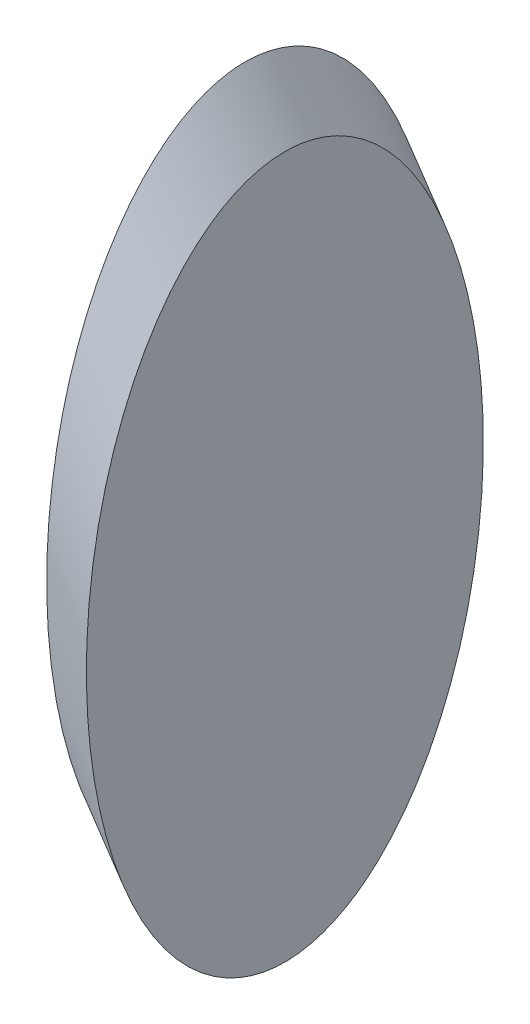
ISO-10303-21;
HEADER;
FILE_DESCRIPTION(('STEP AP214'),'2;1');
FILE_NAME('part.step','',(''),(''),'','','');
FILE_SCHEMA(('AUTOMOTIVE_DESIGN { 1 0 10303 214 1 1 1 1 }'));
ENDSEC;
DATA;
#1=APPLICATION_CONTEXT('core data for automotive mechanical design processes');
#2=APPLICATION_PROTOCOL_DEFINITION('international standard','automotive_design',2000,#1);
#3=PRODUCT_CONTEXT('',#1,'mechanical');
#4=PRODUCT('Part','Part','',(#3));
#5=PRODUCT_RELATED_PRODUCT_CATEGORY('part','',(#4));
#6=PRODUCT_DEFINITION_FORMATION('','',#4);
#7=PRODUCT_DEFINITION_CONTEXT('part definition',#1,'design');
#8=PRODUCT_DEFINITION('design','',#6,#7);
#9=PRODUCT_DEFINITION_SHAPE('','',#8);
#10=(LENGTH_UNIT() NAMED_UNIT(*) SI_UNIT(.MILLI.,.METRE.));
#11=(NAMED_UNIT(*) PLANE_ANGLE_UNIT() SI_UNIT($,.RADIAN.));
#12=(NAMED_UNIT(*) SI_UNIT($,.STERADIAN.) SOLID_ANGLE_UNIT());
#13=UNCERTAINTY_MEASURE_WITH_UNIT(LENGTH_MEASURE(1.E-05),#10,'distance_accuracy_value','');
#14=(GEOMETRIC_REPRESENTATION_CONTEXT(3) GLOBAL_UNCERTAINTY_ASSIGNED_CONTEXT((#13)) GLOBAL_UNIT_ASSIGNED_CONTEXT((#10,
#11,#12)) REPRESENTATION_CONTEXT('',''));
#15=CARTESIAN_POINT('',(0.,0.,0.));
#16=DIRECTION('',(0.,0.,1.));
#17=DIRECTION('',(1.,0.,0.));
#18=AXIS2_PLACEMENT_3D('',#15,#16,#17);
#19=CARTESIAN_POINT('',(-0.999999999999999,19.1437673822593,-10.));
#20=DIRECTION('',(-1.,0.,0.));
#21=DIRECTION('',(0.,0.,1.));
#22=AXIS2_PLACEMENT_3D('',#19,#20,#21);
#23=PLANE('',#22);
#24=CARTESIAN_POINT('',(-0.999999999999997,1.45864203475964,0.));
#25=DIRECTION('',(-1.,0.,0.));
#26=DIRECTION('',(0.,1.,0.));
#27=AXIS2_PLACEMENT_3D('',#24,#25,#26);
#28=ELLIPSE('',#27,17.6851253474996,10.);
#29=CARTESIAN_POINT('',(-0.999999999999997,19.1437673822593,0.));
#30=VERTEX_POINT('',#29);
#31=EDGE_CURVE('E18',#30,#30,#28,.F.);
#32=ORIENTED_EDGE('',*,*,#31,.F.);
#33=EDGE_LOOP('',(#32));
#34=FACE_BOUND('',#33,.T.);
#35=ADVANCED_FACE('F15',(#34),#23,.T.);
#36=CARTESIAN_POINT('',(28.272346968165,-41.2392337090748,0.));
#37=DIRECTION('',(-0.5654469393633,0.824784674181496,0.));
#38=DIRECTION('',(-0.824784674181496,-0.5654469393633,0.));
#39=AXIS2_PLACEMENT_3D('',#36,#37,#38);
#40=CYLINDRICAL_SURFACE('',#39,10.);
#41=ORIENTED_EDGE('',*,*,#31,.T.);
#42=EDGE_LOOP('',(#41));
#43=FACE_BOUND('',#42,.T.);
#44=CARTESIAN_POINT('',(1.,-1.45864203475964,0.));
#45=DIRECTION('',(1.,0.,0.));
#46=DIRECTION('',(0.,1.,0.));
#47=AXIS2_PLACEMENT_3D('',#44,#45,#46);
#48=ELLIPSE('',#47,17.6851253474996,10.);
#49=CARTESIAN_POINT('',(0.999999999999998,16.22648331274,0.));
#50=VERTEX_POINT('',#49);
#51=EDGE_CURVE('E9',#50,#50,#48,.T.);
#52=ORIENTED_EDGE('',*,*,#51,.F.);
#53=EDGE_LOOP('',(#52));
#54=FACE_BOUND('',#53,.T.);
#55=ADVANCED_FACE('F27',(#43,#54),#40,.T.);
#56=CARTESIAN_POINT('',(0.999999999999995,16.22648331274,-10.));
#57=DIRECTION('',(1.,0.,0.));
#58=DIRECTION('',(0.,1.,0.));
#59=AXIS2_PLACEMENT_3D('',#56,#57,#58);
#60=PLANE('',#59);
#61=ORIENTED_EDGE('',*,*,#51,.T.);
#62=EDGE_LOOP('',(#61));
#63=FACE_BOUND('',#62,.T.);
#64=ADVANCED_FACE('F34',(#63),#60,.T.);
#65=CLOSED_SHELL('',(#35,#55,#64));
#66=MANIFOLD_SOLID_BREP('B1',#65);
#67=ADVANCED_BREP_SHAPE_REPRESENTATION('',(#18,#66),#14);
#68=SHAPE_DEFINITION_REPRESENTATION(#9,#67);
ENDSEC;
END-ISO-10303-21;
